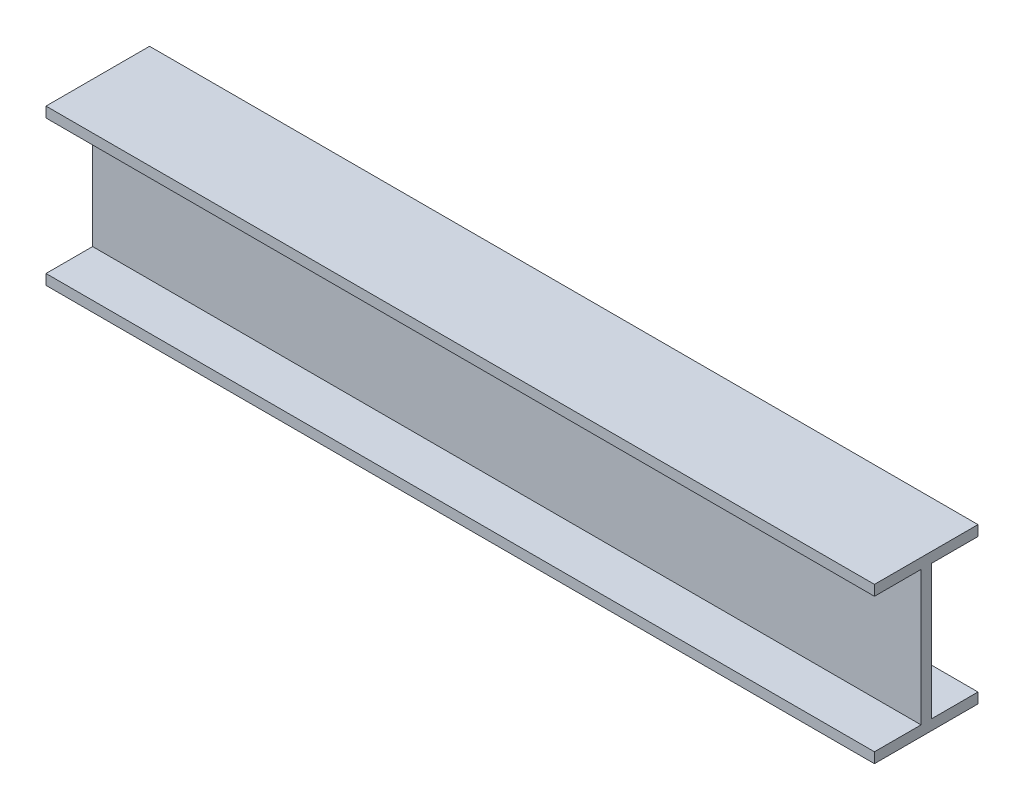
ISO-10303-21;
HEADER;
FILE_DESCRIPTION(('STEP AP214'),'2;1');
FILE_NAME('part.step','',(''),(''),'','','');
FILE_SCHEMA(('AUTOMOTIVE_DESIGN { 1 0 10303 214 1 1 1 1 }'));
ENDSEC;
DATA;
#1=APPLICATION_CONTEXT('core data for automotive mechanical design processes');
#2=APPLICATION_PROTOCOL_DEFINITION('international standard','automotive_design',2000,#1);
#3=PRODUCT_CONTEXT('',#1,'mechanical');
#4=PRODUCT('Part','Part','',(#3));
#5=PRODUCT_RELATED_PRODUCT_CATEGORY('part','',(#4));
#6=PRODUCT_DEFINITION_FORMATION('','',#4);
#7=PRODUCT_DEFINITION_CONTEXT('part definition',#1,'design');
#8=PRODUCT_DEFINITION('design','',#6,#7);
#9=PRODUCT_DEFINITION_SHAPE('','',#8);
#10=(LENGTH_UNIT() NAMED_UNIT(*) SI_UNIT(.MILLI.,.METRE.));
#11=(NAMED_UNIT(*) PLANE_ANGLE_UNIT() SI_UNIT($,.RADIAN.));
#12=(NAMED_UNIT(*) SI_UNIT($,.STERADIAN.) SOLID_ANGLE_UNIT());
#13=UNCERTAINTY_MEASURE_WITH_UNIT(LENGTH_MEASURE(1.E-05),#10,'distance_accuracy_value','');
#14=(GEOMETRIC_REPRESENTATION_CONTEXT(3) GLOBAL_UNCERTAINTY_ASSIGNED_CONTEXT((#13)) GLOBAL_UNIT_ASSIGNED_CONTEXT((#10,
#11,#12)) REPRESENTATION_CONTEXT('',''));
#15=CARTESIAN_POINT('',(0.,0.,0.));
#16=DIRECTION('',(0.,0.,1.));
#17=DIRECTION('',(1.,0.,0.));
#18=AXIS2_PLACEMENT_3D('',#15,#16,#17);
#19=CARTESIAN_POINT('',(400.,28.2562696252878,50.));
#20=DIRECTION('',(0.,0.,-1.));
#21=DIRECTION('',(-1.,0.,0.));
#22=AXIS2_PLACEMENT_3D('',#19,#20,#21);
#23=PLANE('',#22);
#24=DIRECTION('',(0.,-1.,0.));
#25=VECTOR('',#24,1.);
#26=CARTESIAN_POINT('',(-400.,28.2562696252878,50.));
#27=LINE('',#26,#25);
#28=CARTESIAN_POINT('',(-400.,28.2562696252878,50.));
#29=VERTEX_POINT('',#28);
#30=CARTESIAN_POINT('',(-400.,18.2562696252878,50.));
#31=VERTEX_POINT('',#30);
#32=EDGE_CURVE('E154',#29,#31,#27,.T.);
#33=ORIENTED_EDGE('',*,*,#32,.T.);
#34=DIRECTION('',(-1.,0.,0.));
#35=VECTOR('',#34,1.);
#36=CARTESIAN_POINT('',(400.,18.2562696252878,50.));
#37=LINE('',#36,#35);
#38=CARTESIAN_POINT('',(400.,18.2562696252878,50.));
#39=VERTEX_POINT('',#38);
#40=EDGE_CURVE('E11',#39,#31,#37,.T.);
#41=ORIENTED_EDGE('',*,*,#40,.F.);
#42=DIRECTION('',(0.,-1.,0.));
#43=VECTOR('',#42,1.);
#44=CARTESIAN_POINT('',(400.,28.2562696252878,50.));
#45=LINE('',#44,#43);
#46=CARTESIAN_POINT('',(400.,28.2562696252878,50.));
#47=VERTEX_POINT('',#46);
#48=EDGE_CURVE('E183',#47,#39,#45,.T.);
#49=ORIENTED_EDGE('',*,*,#48,.F.);
#50=DIRECTION('',(-1.,0.,0.));
#51=VECTOR('',#50,1.);
#52=CARTESIAN_POINT('',(400.,28.2562696252878,50.));
#53=LINE('',#52,#51);
#54=EDGE_CURVE('E50',#47,#29,#53,.T.);
#55=ORIENTED_EDGE('',*,*,#54,.T.);
#56=EDGE_LOOP('',(#33,#41,#49,#55));
#57=FACE_BOUND('',#56,.T.);
#58=ADVANCED_FACE('F34',(#57),#23,.F.);
#59=CARTESIAN_POINT('',(400.,18.2562696252878,50.));
#60=DIRECTION('',(0.,1.,0.));
#61=DIRECTION('',(0.,0.,1.));
#62=AXIS2_PLACEMENT_3D('',#59,#60,#61);
#63=PLANE('',#62);
#64=DIRECTION('',(0.,0.,-1.));
#65=VECTOR('',#64,1.);
#66=CARTESIAN_POINT('',(-400.,18.2562696252878,50.));
#67=LINE('',#66,#65);
#68=CARTESIAN_POINT('',(-400.,18.2562696252878,5.));
#69=VERTEX_POINT('',#68);
#70=EDGE_CURVE('E156',#31,#69,#67,.T.);
#71=ORIENTED_EDGE('',*,*,#70,.T.);
#72=DIRECTION('',(-1.,0.,0.));
#73=VECTOR('',#72,1.);
#74=CARTESIAN_POINT('',(400.,18.2562696252878,5.));
#75=LINE('',#74,#73);
#76=CARTESIAN_POINT('',(400.,18.2562696252878,5.));
#77=VERTEX_POINT('',#76);
#78=EDGE_CURVE('E42',#77,#69,#75,.T.);
#79=ORIENTED_EDGE('',*,*,#78,.F.);
#80=DIRECTION('',(0.,0.,-1.));
#81=VECTOR('',#80,1.);
#82=CARTESIAN_POINT('',(400.,18.2562696252878,50.));
#83=LINE('',#82,#81);
#84=EDGE_CURVE('E100',#39,#77,#83,.T.);
#85=ORIENTED_EDGE('',*,*,#84,.F.);
#86=ORIENTED_EDGE('',*,*,#40,.T.);
#87=EDGE_LOOP('',(#71,#79,#85,#86));
#88=FACE_BOUND('',#87,.T.);
#89=ADVANCED_FACE('F246',(#88),#63,.F.);
#90=CARTESIAN_POINT('',(400.,18.2562696252878,5.));
#91=DIRECTION('',(0.,0.,-1.));
#92=DIRECTION('',(-1.,0.,0.));
#93=AXIS2_PLACEMENT_3D('',#90,#91,#92);
#94=PLANE('',#93);
#95=DIRECTION('',(0.,-1.,0.));
#96=VECTOR('',#95,1.);
#97=CARTESIAN_POINT('',(-400.,18.2562696252878,5.));
#98=LINE('',#97,#96);
#99=CARTESIAN_POINT('',(-400.,-111.743730374712,5.));
#100=VERTEX_POINT('',#99);
#101=EDGE_CURVE('E158',#69,#100,#98,.T.);
#102=ORIENTED_EDGE('',*,*,#101,.T.);
#103=DIRECTION('',(-1.,0.,0.));
#104=VECTOR('',#103,1.);
#105=CARTESIAN_POINT('',(400.,-111.743730374712,5.));
#106=LINE('',#105,#104);
#107=CARTESIAN_POINT('',(400.,-111.743730374712,5.));
#108=VERTEX_POINT('',#107);
#109=EDGE_CURVE('E199',#108,#100,#106,.T.);
#110=ORIENTED_EDGE('',*,*,#109,.F.);
#111=DIRECTION('',(0.,-1.,0.));
#112=VECTOR('',#111,1.);
#113=CARTESIAN_POINT('',(400.,18.2562696252878,5.));
#114=LINE('',#113,#112);
#115=EDGE_CURVE('E206',#77,#108,#114,.T.);
#116=ORIENTED_EDGE('',*,*,#115,.F.);
#117=ORIENTED_EDGE('',*,*,#78,.T.);
#118=EDGE_LOOP('',(#102,#110,#116,#117));
#119=FACE_BOUND('',#118,.T.);
#120=ADVANCED_FACE('F204',(#119),#94,.F.);
#121=CARTESIAN_POINT('',(400.,-111.743730374712,50.));
#122=DIRECTION('',(0.,1.,0.));
#123=DIRECTION('',(0.,0.,1.));
#124=AXIS2_PLACEMENT_3D('',#121,#122,#123);
#125=PLANE('',#124);
#126=DIRECTION('',(0.,0.,-1.));
#127=VECTOR('',#126,1.);
#128=CARTESIAN_POINT('',(-400.,-111.743730374712,50.));
#129=LINE('',#128,#127);
#130=CARTESIAN_POINT('',(-400.,-111.743730374712,50.));
#131=VERTEX_POINT('',#130);
#132=EDGE_CURVE('E161',#131,#100,#129,.T.);
#133=ORIENTED_EDGE('',*,*,#132,.F.);
#134=DIRECTION('',(-1.,0.,0.));
#135=VECTOR('',#134,1.);
#136=CARTESIAN_POINT('',(400.,-111.743730374712,50.));
#137=LINE('',#136,#135);
#138=CARTESIAN_POINT('',(400.,-111.743730374712,50.));
#139=VERTEX_POINT('',#138);
#140=EDGE_CURVE('E197',#139,#131,#137,.T.);
#141=ORIENTED_EDGE('',*,*,#140,.F.);
#142=DIRECTION('',(0.,0.,-1.));
#143=VECTOR('',#142,1.);
#144=CARTESIAN_POINT('',(400.,-111.743730374712,50.));
#145=LINE('',#144,#143);
#146=EDGE_CURVE('E216',#139,#108,#145,.T.);
#147=ORIENTED_EDGE('',*,*,#146,.T.);
#148=ORIENTED_EDGE('',*,*,#109,.T.);
#149=EDGE_LOOP('',(#133,#141,#147,#148));
#150=FACE_BOUND('',#149,.T.);
#151=ADVANCED_FACE('F213',(#150),#125,.T.);
#152=CARTESIAN_POINT('',(400.,-121.743730374712,50.));
#153=DIRECTION('',(0.,0.,1.));
#154=DIRECTION('',(1.,0.,0.));
#155=AXIS2_PLACEMENT_3D('',#152,#153,#154);
#156=PLANE('',#155);
#157=DIRECTION('',(0.,1.,0.));
#158=VECTOR('',#157,1.);
#159=CARTESIAN_POINT('',(-400.,-121.743730374712,50.));
#160=LINE('',#159,#158);
#161=CARTESIAN_POINT('',(-400.,-121.743730374712,50.));
#162=VERTEX_POINT('',#161);
#163=EDGE_CURVE('E164',#162,#131,#160,.T.);
#164=ORIENTED_EDGE('',*,*,#163,.F.);
#165=DIRECTION('',(-1.,0.,0.));
#166=VECTOR('',#165,1.);
#167=CARTESIAN_POINT('',(400.,-121.743730374712,50.));
#168=LINE('',#167,#166);
#169=CARTESIAN_POINT('',(400.,-121.743730374712,50.));
#170=VERTEX_POINT('',#169);
#171=EDGE_CURVE('E195',#170,#162,#168,.T.);
#172=ORIENTED_EDGE('',*,*,#171,.F.);
#173=DIRECTION('',(0.,1.,0.));
#174=VECTOR('',#173,1.);
#175=CARTESIAN_POINT('',(400.,-121.743730374712,50.));
#176=LINE('',#175,#174);
#177=EDGE_CURVE('E219',#170,#139,#176,.T.);
#178=ORIENTED_EDGE('',*,*,#177,.T.);
#179=ORIENTED_EDGE('',*,*,#140,.T.);
#180=EDGE_LOOP('',(#164,#172,#178,#179));
#181=FACE_BOUND('',#180,.T.);
#182=ADVANCED_FACE('F259',(#181),#156,.T.);
#183=CARTESIAN_POINT('',(400.,-121.743730374712,50.));
#184=DIRECTION('',(0.,1.,0.));
#185=DIRECTION('',(0.,0.,1.));
#186=AXIS2_PLACEMENT_3D('',#183,#184,#185);
#187=PLANE('',#186);
#188=DIRECTION('',(0.,0.,-1.));
#189=VECTOR('',#188,1.);
#190=CARTESIAN_POINT('',(-400.,-121.743730374712,50.));
#191=LINE('',#190,#189);
#192=CARTESIAN_POINT('',(-400.,-121.743730374712,-50.));
#193=VERTEX_POINT('',#192);
#194=EDGE_CURVE('E167',#162,#193,#191,.T.);
#195=ORIENTED_EDGE('',*,*,#194,.T.);
#196=DIRECTION('',(-1.,0.,0.));
#197=VECTOR('',#196,1.);
#198=CARTESIAN_POINT('',(400.,-121.743730374712,-50.));
#199=LINE('',#198,#197);
#200=CARTESIAN_POINT('',(400.,-121.743730374712,-50.));
#201=VERTEX_POINT('',#200);
#202=EDGE_CURVE('E192',#201,#193,#199,.T.);
#203=ORIENTED_EDGE('',*,*,#202,.F.);
#204=DIRECTION('',(0.,0.,-1.));
#205=VECTOR('',#204,1.);
#206=CARTESIAN_POINT('',(400.,-121.743730374712,50.));
#207=LINE('',#206,#205);
#208=EDGE_CURVE('E221',#170,#201,#207,.T.);
#209=ORIENTED_EDGE('',*,*,#208,.F.);
#210=ORIENTED_EDGE('',*,*,#171,.T.);
#211=EDGE_LOOP('',(#195,#203,#209,#210));
#212=FACE_BOUND('',#211,.T.);
#213=ADVANCED_FACE('F262',(#212),#187,.F.);
#214=CARTESIAN_POINT('',(400.,-121.743730374712,-50.));
#215=DIRECTION('',(0.,0.,1.));
#216=DIRECTION('',(1.,0.,0.));
#217=AXIS2_PLACEMENT_3D('',#214,#215,#216);
#218=PLANE('',#217);
#219=DIRECTION('',(0.,1.,0.));
#220=VECTOR('',#219,1.);
#221=CARTESIAN_POINT('',(-400.,-121.743730374712,-50.));
#222=LINE('',#221,#220);
#223=CARTESIAN_POINT('',(-400.,-111.743730374712,-50.));
#224=VERTEX_POINT('',#223);
#225=EDGE_CURVE('E169',#193,#224,#222,.T.);
#226=ORIENTED_EDGE('',*,*,#225,.T.);
#227=DIRECTION('',(-1.,0.,0.));
#228=VECTOR('',#227,1.);
#229=CARTESIAN_POINT('',(400.,-111.743730374712,-50.));
#230=LINE('',#229,#228);
#231=CARTESIAN_POINT('',(400.,-111.743730374712,-50.));
#232=VERTEX_POINT('',#231);
#233=EDGE_CURVE('E189',#232,#224,#230,.T.);
#234=ORIENTED_EDGE('',*,*,#233,.F.);
#235=DIRECTION('',(0.,1.,0.));
#236=VECTOR('',#235,1.);
#237=CARTESIAN_POINT('',(400.,-121.743730374712,-50.));
#238=LINE('',#237,#236);
#239=EDGE_CURVE('E227',#201,#232,#238,.T.);
#240=ORIENTED_EDGE('',*,*,#239,.F.);
#241=ORIENTED_EDGE('',*,*,#202,.T.);
#242=EDGE_LOOP('',(#226,#234,#240,#241));
#243=FACE_BOUND('',#242,.T.);
#244=ADVANCED_FACE('F266',(#243),#218,.F.);
#245=CARTESIAN_POINT('',(400.,-111.743730374712,-50.));
#246=DIRECTION('',(0.,-1.,0.));
#247=DIRECTION('',(0.,0.,-1.));
#248=AXIS2_PLACEMENT_3D('',#245,#246,#247);
#249=PLANE('',#248);
#250=DIRECTION('',(0.,0.,1.));
#251=VECTOR('',#250,1.);
#252=CARTESIAN_POINT('',(-400.,-111.743730374712,-50.));
#253=LINE('',#252,#251);
#254=CARTESIAN_POINT('',(-400.,-111.743730374712,-5.));
#255=VERTEX_POINT('',#254);
#256=EDGE_CURVE('E171',#224,#255,#253,.T.);
#257=ORIENTED_EDGE('',*,*,#256,.T.);
#258=DIRECTION('',(-1.,0.,0.));
#259=VECTOR('',#258,1.);
#260=CARTESIAN_POINT('',(400.,-111.743730374712,-5.));
#261=LINE('',#260,#259);
#262=CARTESIAN_POINT('',(400.,-111.743730374712,-5.));
#263=VERTEX_POINT('',#262);
#264=EDGE_CURVE('E187',#263,#255,#261,.T.);
#265=ORIENTED_EDGE('',*,*,#264,.F.);
#266=DIRECTION('',(0.,0.,1.));
#267=VECTOR('',#266,1.);
#268=CARTESIAN_POINT('',(400.,-111.743730374712,-50.));
#269=LINE('',#268,#267);
#270=EDGE_CURVE('E229',#232,#263,#269,.T.);
#271=ORIENTED_EDGE('',*,*,#270,.F.);
#272=ORIENTED_EDGE('',*,*,#233,.T.);
#273=EDGE_LOOP('',(#257,#265,#271,#272));
#274=FACE_BOUND('',#273,.T.);
#275=ADVANCED_FACE('F270',(#274),#249,.F.);
#276=CARTESIAN_POINT('',(400.,18.2562696252878,-5.));
#277=DIRECTION('',(0.,0.,-1.));
#278=DIRECTION('',(-1.,0.,0.));
#279=AXIS2_PLACEMENT_3D('',#276,#277,#278);
#280=PLANE('',#279);
#281=DIRECTION('',(0.,-1.,0.));
#282=VECTOR('',#281,1.);
#283=CARTESIAN_POINT('',(-400.,18.2562696252878,-5.));
#284=LINE('',#283,#282);
#285=CARTESIAN_POINT('',(-400.,18.2562696252878,-5.));
#286=VERTEX_POINT('',#285);
#287=EDGE_CURVE('E174',#286,#255,#284,.T.);
#288=ORIENTED_EDGE('',*,*,#287,.F.);
#289=DIRECTION('',(-1.,0.,0.));
#290=VECTOR('',#289,1.);
#291=CARTESIAN_POINT('',(400.,18.2562696252878,-5.));
#292=LINE('',#291,#290);
#293=CARTESIAN_POINT('',(400.,18.2562696252878,-5.));
#294=VERTEX_POINT('',#293);
#295=EDGE_CURVE('E137',#294,#286,#292,.T.);
#296=ORIENTED_EDGE('',*,*,#295,.F.);
#297=DIRECTION('',(0.,-1.,0.));
#298=VECTOR('',#297,1.);
#299=CARTESIAN_POINT('',(400.,18.2562696252878,-5.));
#300=LINE('',#299,#298);
#301=EDGE_CURVE('E146',#294,#263,#300,.T.);
#302=ORIENTED_EDGE('',*,*,#301,.T.);
#303=ORIENTED_EDGE('',*,*,#264,.T.);
#304=EDGE_LOOP('',(#288,#296,#302,#303));
#305=FACE_BOUND('',#304,.T.);
#306=ADVANCED_FACE('F232',(#305),#280,.T.);
#307=CARTESIAN_POINT('',(400.,18.2562696252878,-50.));
#308=DIRECTION('',(0.,-1.,0.));
#309=DIRECTION('',(0.,0.,-1.));
#310=AXIS2_PLACEMENT_3D('',#307,#308,#309);
#311=PLANE('',#310);
#312=DIRECTION('',(0.,0.,1.));
#313=VECTOR('',#312,1.);
#314=CARTESIAN_POINT('',(-400.,18.2562696252878,-50.));
#315=LINE('',#314,#313);
#316=CARTESIAN_POINT('',(-400.,18.2562696252878,-50.));
#317=VERTEX_POINT('',#316);
#318=EDGE_CURVE('E133',#317,#286,#315,.T.);
#319=ORIENTED_EDGE('',*,*,#318,.F.);
#320=DIRECTION('',(-1.,0.,0.));
#321=VECTOR('',#320,1.);
#322=CARTESIAN_POINT('',(400.,18.2562696252878,-50.));
#323=LINE('',#322,#321);
#324=CARTESIAN_POINT('',(400.,18.2562696252878,-50.));
#325=VERTEX_POINT('',#324);
#326=EDGE_CURVE('E128',#325,#317,#323,.T.);
#327=ORIENTED_EDGE('',*,*,#326,.F.);
#328=DIRECTION('',(0.,0.,1.));
#329=VECTOR('',#328,1.);
#330=CARTESIAN_POINT('',(400.,18.2562696252878,-50.));
#331=LINE('',#330,#329);
#332=EDGE_CURVE('E131',#325,#294,#331,.T.);
#333=ORIENTED_EDGE('',*,*,#332,.T.);
#334=ORIENTED_EDGE('',*,*,#295,.T.);
#335=EDGE_LOOP('',(#319,#327,#333,#334));
#336=FACE_BOUND('',#335,.T.);
#337=ADVANCED_FACE('F130',(#336),#311,.T.);
#338=CARTESIAN_POINT('',(400.,28.2562696252878,-50.));
#339=DIRECTION('',(0.,0.,-1.));
#340=DIRECTION('',(-1.,0.,0.));
#341=AXIS2_PLACEMENT_3D('',#338,#339,#340);
#342=PLANE('',#341);
#343=DIRECTION('',(0.,-1.,0.));
#344=VECTOR('',#343,1.);
#345=CARTESIAN_POINT('',(-400.,28.2562696252878,-50.));
#346=LINE('',#345,#344);
#347=CARTESIAN_POINT('',(-400.,28.2562696252878,-50.));
#348=VERTEX_POINT('',#347);
#349=EDGE_CURVE('E178',#348,#317,#346,.T.);
#350=ORIENTED_EDGE('',*,*,#349,.F.);
#351=DIRECTION('',(-1.,0.,0.));
#352=VECTOR('',#351,1.);
#353=CARTESIAN_POINT('',(400.,28.2562696252878,-50.));
#354=LINE('',#353,#352);
#355=CARTESIAN_POINT('',(400.,28.2562696252878,-50.));
#356=VERTEX_POINT('',#355);
#357=EDGE_CURVE('E88',#356,#348,#354,.T.);
#358=ORIENTED_EDGE('',*,*,#357,.F.);
#359=DIRECTION('',(0.,-1.,0.));
#360=VECTOR('',#359,1.);
#361=CARTESIAN_POINT('',(400.,28.2562696252878,-50.));
#362=LINE('',#361,#360);
#363=EDGE_CURVE('E144',#356,#325,#362,.T.);
#364=ORIENTED_EDGE('',*,*,#363,.T.);
#365=ORIENTED_EDGE('',*,*,#326,.T.);
#366=EDGE_LOOP('',(#350,#358,#364,#365));
#367=FACE_BOUND('',#366,.T.);
#368=ADVANCED_FACE('F148',(#367),#342,.T.);
#369=CARTESIAN_POINT('',(400.,28.2562696252878,50.));
#370=DIRECTION('',(0.,1.,0.));
#371=DIRECTION('',(0.,0.,1.));
#372=AXIS2_PLACEMENT_3D('',#369,#370,#371);
#373=PLANE('',#372);
#374=DIRECTION('',(0.,0.,-1.));
#375=VECTOR('',#374,1.);
#376=CARTESIAN_POINT('',(-400.,28.2562696252878,50.));
#377=LINE('',#376,#375);
#378=EDGE_CURVE('E180',#29,#348,#377,.T.);
#379=ORIENTED_EDGE('',*,*,#378,.F.);
#380=ORIENTED_EDGE('',*,*,#54,.F.);
#381=DIRECTION('',(0.,0.,-1.));
#382=VECTOR('',#381,1.);
#383=CARTESIAN_POINT('',(400.,28.2562696252878,50.));
#384=LINE('',#383,#382);
#385=EDGE_CURVE('E149',#47,#356,#384,.T.);
#386=ORIENTED_EDGE('',*,*,#385,.T.);
#387=ORIENTED_EDGE('',*,*,#357,.T.);
#388=EDGE_LOOP('',(#379,#380,#386,#387));
#389=FACE_BOUND('',#388,.T.);
#390=ADVANCED_FACE('F235',(#389),#373,.T.);
#391=CARTESIAN_POINT('',(400.,0.,0.));
#392=DIRECTION('',(1.,0.,0.));
#393=DIRECTION('',(0.,0.,-1.));
#394=AXIS2_PLACEMENT_3D('',#391,#392,#393);
#395=PLANE('',#394);
#396=ORIENTED_EDGE('',*,*,#48,.T.);
#397=ORIENTED_EDGE('',*,*,#84,.T.);
#398=ORIENTED_EDGE('',*,*,#115,.T.);
#399=ORIENTED_EDGE('',*,*,#146,.F.);
#400=ORIENTED_EDGE('',*,*,#177,.F.);
#401=ORIENTED_EDGE('',*,*,#208,.T.);
#402=ORIENTED_EDGE('',*,*,#239,.T.);
#403=ORIENTED_EDGE('',*,*,#270,.T.);
#404=ORIENTED_EDGE('',*,*,#301,.F.);
#405=ORIENTED_EDGE('',*,*,#332,.F.);
#406=ORIENTED_EDGE('',*,*,#363,.F.);
#407=ORIENTED_EDGE('',*,*,#385,.F.);
#408=EDGE_LOOP('',(#396,#397,#398,#399,#400,#401,#402,#403,#404,#405,#406,#407));
#409=FACE_BOUND('',#408,.T.);
#410=ADVANCED_FACE('F142',(#409),#395,.T.);
#411=CARTESIAN_POINT('',(-400.,0.,0.));
#412=DIRECTION('',(1.,0.,0.));
#413=DIRECTION('',(0.,0.,-1.));
#414=AXIS2_PLACEMENT_3D('',#411,#412,#413);
#415=PLANE('',#414);
#416=ORIENTED_EDGE('',*,*,#32,.F.);
#417=ORIENTED_EDGE('',*,*,#378,.T.);
#418=ORIENTED_EDGE('',*,*,#349,.T.);
#419=ORIENTED_EDGE('',*,*,#318,.T.);
#420=ORIENTED_EDGE('',*,*,#287,.T.);
#421=ORIENTED_EDGE('',*,*,#256,.F.);
#422=ORIENTED_EDGE('',*,*,#225,.F.);
#423=ORIENTED_EDGE('',*,*,#194,.F.);
#424=ORIENTED_EDGE('',*,*,#163,.T.);
#425=ORIENTED_EDGE('',*,*,#132,.T.);
#426=ORIENTED_EDGE('',*,*,#101,.F.);
#427=ORIENTED_EDGE('',*,*,#70,.F.);
#428=EDGE_LOOP('',(#416,#417,#418,#419,#420,#421,#422,#423,#424,#425,#426,#427));
#429=FACE_BOUND('',#428,.T.);
#430=ADVANCED_FACE('F208',(#429),#415,.F.);
#431=CLOSED_SHELL('',(#58,#89,#120,#151,#182,#213,#244,#275,#306,#337,#368,#390,#410,#430));
#432=MANIFOLD_SOLID_BREP('B2',#431);
#433=ADVANCED_BREP_SHAPE_REPRESENTATION('',(#18,#432),#14);
#434=SHAPE_DEFINITION_REPRESENTATION(#9,#433);
ENDSEC;
END-ISO-10303-21;
